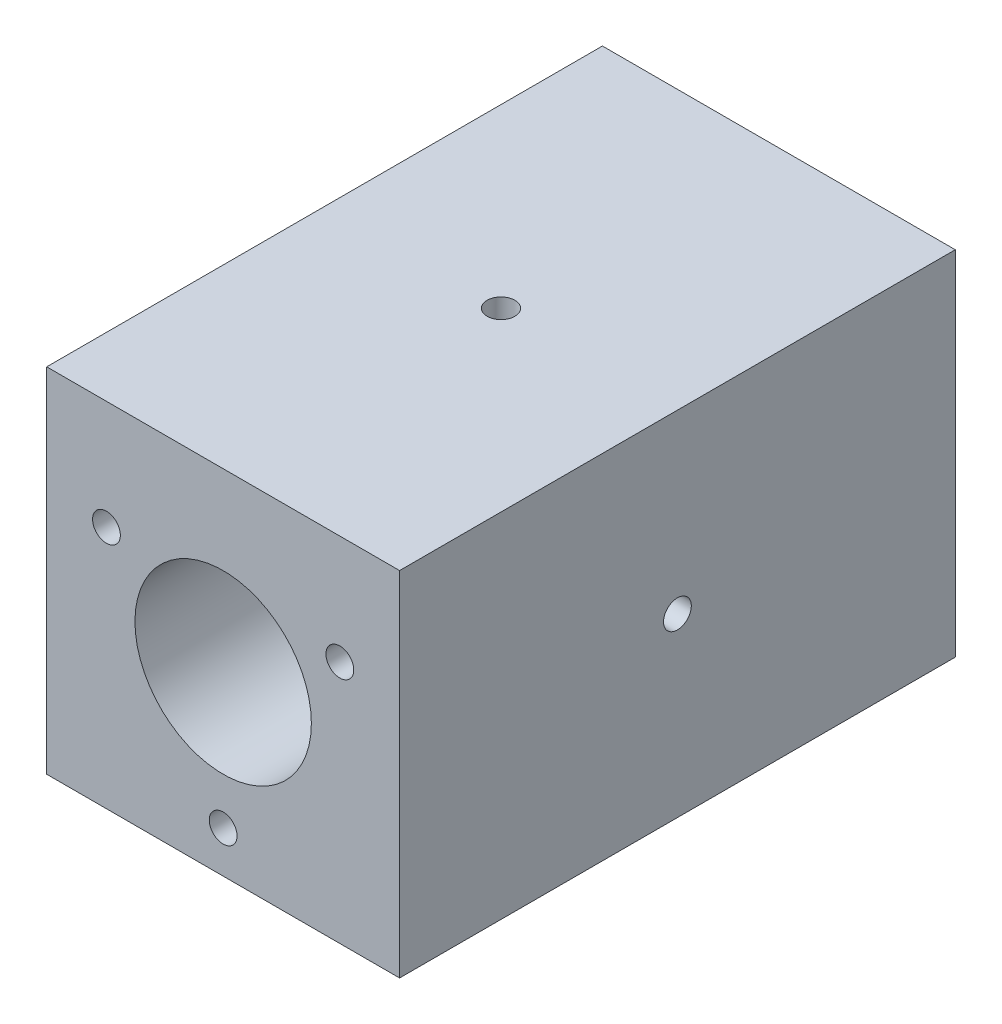
ISO-10303-21;
HEADER;
FILE_DESCRIPTION(('STEP AP214'),'2;1');
FILE_NAME('part.step','',(''),(''),'','','');
FILE_SCHEMA(('AUTOMOTIVE_DESIGN { 1 0 10303 214 1 1 1 1 }'));
ENDSEC;
DATA;
#1=APPLICATION_CONTEXT('core data for automotive mechanical design processes');
#2=APPLICATION_PROTOCOL_DEFINITION('international standard','automotive_design',2000,#1);
#3=PRODUCT_CONTEXT('',#1,'mechanical');
#4=PRODUCT('Part','Part','',(#3));
#5=PRODUCT_RELATED_PRODUCT_CATEGORY('part','',(#4));
#6=PRODUCT_DEFINITION_FORMATION('','',#4);
#7=PRODUCT_DEFINITION_CONTEXT('part definition',#1,'design');
#8=PRODUCT_DEFINITION('design','',#6,#7);
#9=PRODUCT_DEFINITION_SHAPE('','',#8);
#10=(LENGTH_UNIT() NAMED_UNIT(*) SI_UNIT(.MILLI.,.METRE.));
#11=(NAMED_UNIT(*) PLANE_ANGLE_UNIT() SI_UNIT($,.RADIAN.));
#12=(NAMED_UNIT(*) SI_UNIT($,.STERADIAN.) SOLID_ANGLE_UNIT());
#13=UNCERTAINTY_MEASURE_WITH_UNIT(LENGTH_MEASURE(1.E-05),#10,'distance_accuracy_value','');
#14=(GEOMETRIC_REPRESENTATION_CONTEXT(3) GLOBAL_UNCERTAINTY_ASSIGNED_CONTEXT((#13)) GLOBAL_UNIT_ASSIGNED_CONTEXT((#10,
#11,#12)) REPRESENTATION_CONTEXT('',''));
#15=CARTESIAN_POINT('',(0.,0.,0.));
#16=DIRECTION('',(0.,0.,1.));
#17=DIRECTION('',(1.,0.,0.));
#18=AXIS2_PLACEMENT_3D('',#15,#16,#17);
#19=CARTESIAN_POINT('',(0.,0.,25.));
#20=DIRECTION('',(0.,0.,-1.));
#21=DIRECTION('',(-1.,0.,0.));
#22=AXIS2_PLACEMENT_3D('',#19,#20,#21);
#23=PLANE('',#22);
#24=DIRECTION('',(0.,-1.,0.));
#25=VECTOR('',#24,1.);
#26=CARTESIAN_POINT('',(-15.875,15.875,25.));
#27=LINE('',#26,#25);
#28=CARTESIAN_POINT('',(-15.875,15.875,25.));
#29=VERTEX_POINT('',#28);
#30=CARTESIAN_POINT('',(-15.875,-15.875,25.));
#31=VERTEX_POINT('',#30);
#32=EDGE_CURVE('E97',#29,#31,#27,.T.);
#33=ORIENTED_EDGE('',*,*,#32,.T.);
#34=DIRECTION('',(1.,0.,0.));
#35=VECTOR('',#34,1.);
#36=CARTESIAN_POINT('',(15.875,-15.875,25.));
#37=LINE('',#36,#35);
#38=CARTESIAN_POINT('',(15.875,-15.875,25.));
#39=VERTEX_POINT('',#38);
#40=EDGE_CURVE('E92',#31,#39,#37,.T.);
#41=ORIENTED_EDGE('',*,*,#40,.T.);
#42=DIRECTION('',(0.,1.,0.));
#43=VECTOR('',#42,1.);
#44=CARTESIAN_POINT('',(15.875,15.875,25.));
#45=LINE('',#44,#43);
#46=CARTESIAN_POINT('',(15.875,15.875,25.));
#47=VERTEX_POINT('',#46);
#48=EDGE_CURVE('E95',#39,#47,#45,.T.);
#49=ORIENTED_EDGE('',*,*,#48,.T.);
#50=DIRECTION('',(-1.,0.,0.));
#51=VECTOR('',#50,1.);
#52=CARTESIAN_POINT('',(15.875,15.875,25.));
#53=LINE('',#52,#51);
#54=EDGE_CURVE('E62',#47,#29,#53,.T.);
#55=ORIENTED_EDGE('',*,*,#54,.T.);
#56=EDGE_LOOP('',(#33,#41,#49,#55));
#57=FACE_BOUND('',#56,.T.);
#58=CARTESIAN_POINT('',(0.,0.,25.));
#59=DIRECTION('',(0.,0.,1.));
#60=DIRECTION('',(1.,0.,0.));
#61=AXIS2_PLACEMENT_3D('',#58,#59,#60);
#62=CIRCLE('',#61,7.9375);
#63=CARTESIAN_POINT('',(7.93750000000001,0.,25.));
#64=VERTEX_POINT('',#63);
#65=EDGE_CURVE('E112',#64,#64,#62,.T.);
#66=ORIENTED_EDGE('',*,*,#65,.F.);
#67=EDGE_LOOP('',(#66));
#68=FACE_BOUND('',#67,.T.);
#69=CARTESIAN_POINT('',(-10.5,6.06217782649108,25.));
#70=DIRECTION('',(0.,0.,1.));
#71=DIRECTION('',(1.,0.,0.));
#72=AXIS2_PLACEMENT_3D('',#69,#70,#71);
#73=CIRCLE('',#72,1.25);
#74=CARTESIAN_POINT('',(-9.25,6.06217782649108,25.));
#75=VERTEX_POINT('',#74);
#76=EDGE_CURVE('E127',#75,#75,#73,.T.);
#77=ORIENTED_EDGE('',*,*,#76,.F.);
#78=EDGE_LOOP('',(#77));
#79=FACE_BOUND('',#78,.T.);
#80=CARTESIAN_POINT('',(10.5,6.06217782649108,25.));
#81=DIRECTION('',(0.,0.,1.));
#82=DIRECTION('',(1.,0.,0.));
#83=AXIS2_PLACEMENT_3D('',#80,#81,#82);
#84=CIRCLE('',#83,1.25);
#85=CARTESIAN_POINT('',(11.75,6.06217782649108,25.));
#86=VERTEX_POINT('',#85);
#87=EDGE_CURVE('E133',#86,#86,#84,.T.);
#88=ORIENTED_EDGE('',*,*,#87,.F.);
#89=EDGE_LOOP('',(#88));
#90=FACE_BOUND('',#89,.T.);
#91=CARTESIAN_POINT('',(0.,-12.1243556529821,25.));
#92=DIRECTION('',(0.,0.,1.));
#93=DIRECTION('',(1.,0.,0.));
#94=AXIS2_PLACEMENT_3D('',#91,#92,#93);
#95=CIRCLE('',#94,1.25);
#96=CARTESIAN_POINT('',(1.25,-12.1243556529821,25.));
#97=VERTEX_POINT('',#96);
#98=EDGE_CURVE('E139',#97,#97,#95,.T.);
#99=ORIENTED_EDGE('',*,*,#98,.F.);
#100=EDGE_LOOP('',(#99));
#101=FACE_BOUND('',#100,.T.);
#102=ADVANCED_FACE('F45',(#57,#68,#79,#90,#101),#23,.F.);
#103=CARTESIAN_POINT('',(0.,0.,-25.));
#104=DIRECTION('',(0.,0.,-1.));
#105=DIRECTION('',(-1.,0.,0.));
#106=AXIS2_PLACEMENT_3D('',#103,#104,#105);
#107=PLANE('',#106);
#108=CARTESIAN_POINT('',(10.5,6.06217782649108,-25.));
#109=DIRECTION('',(0.,0.,1.));
#110=DIRECTION('',(1.,0.,0.));
#111=AXIS2_PLACEMENT_3D('',#108,#109,#110);
#112=CIRCLE('',#111,1.25);
#113=CARTESIAN_POINT('',(11.75,6.06217782649108,-25.));
#114=VERTEX_POINT('',#113);
#115=EDGE_CURVE('E136',#114,#114,#112,.T.);
#116=ORIENTED_EDGE('',*,*,#115,.T.);
#117=EDGE_LOOP('',(#116));
#118=FACE_BOUND('',#117,.T.);
#119=CARTESIAN_POINT('',(0.,0.,-25.));
#120=DIRECTION('',(0.,0.,1.));
#121=DIRECTION('',(1.,0.,0.));
#122=AXIS2_PLACEMENT_3D('',#119,#120,#121);
#123=CIRCLE('',#122,7.9375);
#124=CARTESIAN_POINT('',(7.93750000000001,0.,-25.));
#125=VERTEX_POINT('',#124);
#126=EDGE_CURVE('E124',#125,#125,#123,.T.);
#127=ORIENTED_EDGE('',*,*,#126,.T.);
#128=EDGE_LOOP('',(#127));
#129=FACE_BOUND('',#128,.T.);
#130=DIRECTION('',(0.,-1.,0.));
#131=VECTOR('',#130,1.);
#132=CARTESIAN_POINT('',(-15.875,15.875,-25.));
#133=LINE('',#132,#131);
#134=CARTESIAN_POINT('',(-15.875,15.875,-25.));
#135=VERTEX_POINT('',#134);
#136=CARTESIAN_POINT('',(-15.875,-15.875,-25.));
#137=VERTEX_POINT('',#136);
#138=EDGE_CURVE('E109',#135,#137,#133,.T.);
#139=ORIENTED_EDGE('',*,*,#138,.F.);
#140=DIRECTION('',(-1.,0.,0.));
#141=VECTOR('',#140,1.);
#142=CARTESIAN_POINT('',(15.875,15.875,-25.));
#143=LINE('',#142,#141);
#144=CARTESIAN_POINT('',(15.875,15.875,-25.));
#145=VERTEX_POINT('',#144);
#146=EDGE_CURVE('E85',#145,#135,#143,.T.);
#147=ORIENTED_EDGE('',*,*,#146,.F.);
#148=DIRECTION('',(0.,1.,0.));
#149=VECTOR('',#148,1.);
#150=CARTESIAN_POINT('',(15.875,15.875,-25.));
#151=LINE('',#150,#149);
#152=CARTESIAN_POINT('',(15.875,-15.875,-25.));
#153=VERTEX_POINT('',#152);
#154=EDGE_CURVE('E79',#153,#145,#151,.T.);
#155=ORIENTED_EDGE('',*,*,#154,.F.);
#156=DIRECTION('',(1.,0.,0.));
#157=VECTOR('',#156,1.);
#158=CARTESIAN_POINT('',(15.875,-15.875,-25.));
#159=LINE('',#158,#157);
#160=EDGE_CURVE('E101',#137,#153,#159,.T.);
#161=ORIENTED_EDGE('',*,*,#160,.F.);
#162=EDGE_LOOP('',(#139,#147,#155,#161));
#163=FACE_BOUND('',#162,.T.);
#164=CARTESIAN_POINT('',(-10.5,6.06217782649108,-25.));
#165=DIRECTION('',(0.,0.,1.));
#166=DIRECTION('',(1.,0.,0.));
#167=AXIS2_PLACEMENT_3D('',#164,#165,#166);
#168=CIRCLE('',#167,1.25);
#169=CARTESIAN_POINT('',(-9.25,6.06217782649108,-25.));
#170=VERTEX_POINT('',#169);
#171=EDGE_CURVE('E130',#170,#170,#168,.T.);
#172=ORIENTED_EDGE('',*,*,#171,.T.);
#173=EDGE_LOOP('',(#172));
#174=FACE_BOUND('',#173,.T.);
#175=CARTESIAN_POINT('',(0.,-12.1243556529821,-25.));
#176=DIRECTION('',(0.,0.,1.));
#177=DIRECTION('',(1.,0.,0.));
#178=AXIS2_PLACEMENT_3D('',#175,#176,#177);
#179=CIRCLE('',#178,1.25);
#180=CARTESIAN_POINT('',(1.25,-12.1243556529821,-25.));
#181=VERTEX_POINT('',#180);
#182=EDGE_CURVE('E142',#181,#181,#179,.T.);
#183=ORIENTED_EDGE('',*,*,#182,.T.);
#184=EDGE_LOOP('',(#183));
#185=FACE_BOUND('',#184,.T.);
#186=ADVANCED_FACE('F120',(#118,#129,#163,#174,#185),#107,.T.);
#187=CARTESIAN_POINT('',(-15.875,15.875,25.));
#188=DIRECTION('',(1.,0.,0.));
#189=DIRECTION('',(0.,1.,0.));
#190=AXIS2_PLACEMENT_3D('',#187,#188,#189);
#191=PLANE('',#190);
#192=ORIENTED_EDGE('',*,*,#138,.T.);
#193=DIRECTION('',(0.,0.,-1.));
#194=VECTOR('',#193,1.);
#195=CARTESIAN_POINT('',(-15.875,-15.875,25.));
#196=LINE('',#195,#194);
#197=EDGE_CURVE('E11',#31,#137,#196,.T.);
#198=ORIENTED_EDGE('',*,*,#197,.F.);
#199=ORIENTED_EDGE('',*,*,#32,.F.);
#200=DIRECTION('',(0.,0.,-1.));
#201=VECTOR('',#200,1.);
#202=CARTESIAN_POINT('',(-15.875,15.875,25.));
#203=LINE('',#202,#201);
#204=EDGE_CURVE('E105',#29,#135,#203,.T.);
#205=ORIENTED_EDGE('',*,*,#204,.T.);
#206=EDGE_LOOP('',(#192,#198,#199,#205));
#207=FACE_BOUND('',#206,.T.);
#208=ADVANCED_FACE('F47',(#207),#191,.F.);
#209=CARTESIAN_POINT('',(15.875,-15.875,25.));
#210=DIRECTION('',(0.,1.,0.));
#211=DIRECTION('',(-1.,0.,0.));
#212=AXIS2_PLACEMENT_3D('',#209,#210,#211);
#213=PLANE('',#212);
#214=ORIENTED_EDGE('',*,*,#160,.T.);
#215=DIRECTION('',(0.,0.,-1.));
#216=VECTOR('',#215,1.);
#217=CARTESIAN_POINT('',(15.875,-15.875,25.));
#218=LINE('',#217,#216);
#219=EDGE_CURVE('E54',#39,#153,#218,.T.);
#220=ORIENTED_EDGE('',*,*,#219,.F.);
#221=ORIENTED_EDGE('',*,*,#40,.F.);
#222=ORIENTED_EDGE('',*,*,#197,.T.);
#223=EDGE_LOOP('',(#214,#220,#221,#222));
#224=FACE_BOUND('',#223,.T.);
#225=ADVANCED_FACE('F100',(#224),#213,.F.);
#226=CARTESIAN_POINT('',(15.875,15.875,25.));
#227=DIRECTION('',(-1.,0.,0.));
#228=DIRECTION('',(0.,-1.,0.));
#229=AXIS2_PLACEMENT_3D('',#226,#227,#228);
#230=PLANE('',#229);
#231=CARTESIAN_POINT('',(15.875,0.,0.));
#232=DIRECTION('',(1.,0.,0.));
#233=DIRECTION('',(0.,0.,-1.));
#234=AXIS2_PLACEMENT_3D('',#231,#232,#233);
#235=CIRCLE('',#234,1.24999999999999);
#236=CARTESIAN_POINT('',(15.875,0.,-1.24999999999999));
#237=VERTEX_POINT('',#236);
#238=EDGE_CURVE('E175',#237,#237,#235,.T.);
#239=ORIENTED_EDGE('',*,*,#238,.F.);
#240=EDGE_LOOP('',(#239));
#241=FACE_BOUND('',#240,.T.);
#242=ORIENTED_EDGE('',*,*,#154,.T.);
#243=DIRECTION('',(0.,0.,-1.));
#244=VECTOR('',#243,1.);
#245=CARTESIAN_POINT('',(15.875,15.875,25.));
#246=LINE('',#245,#244);
#247=EDGE_CURVE('E102',#47,#145,#246,.T.);
#248=ORIENTED_EDGE('',*,*,#247,.F.);
#249=ORIENTED_EDGE('',*,*,#48,.F.);
#250=ORIENTED_EDGE('',*,*,#219,.T.);
#251=EDGE_LOOP('',(#242,#248,#249,#250));
#252=FACE_BOUND('',#251,.T.);
#253=ADVANCED_FACE('F103',(#241,#252),#230,.F.);
#254=CARTESIAN_POINT('',(15.875,15.875,25.));
#255=DIRECTION('',(0.,-1.,0.));
#256=DIRECTION('',(1.,0.,0.));
#257=AXIS2_PLACEMENT_3D('',#254,#255,#256);
#258=PLANE('',#257);
#259=CARTESIAN_POINT('',(0.,15.875,0.));
#260=DIRECTION('',(0.,1.,0.));
#261=DIRECTION('',(0.,0.,1.));
#262=AXIS2_PLACEMENT_3D('',#259,#260,#261);
#263=CIRCLE('',#262,1.25);
#264=CARTESIAN_POINT('',(0.,15.875,1.25));
#265=VERTEX_POINT('',#264);
#266=EDGE_CURVE('E155',#265,#265,#263,.T.);
#267=ORIENTED_EDGE('',*,*,#266,.F.);
#268=EDGE_LOOP('',(#267));
#269=FACE_BOUND('',#268,.T.);
#270=ORIENTED_EDGE('',*,*,#146,.T.);
#271=ORIENTED_EDGE('',*,*,#204,.F.);
#272=ORIENTED_EDGE('',*,*,#54,.F.);
#273=ORIENTED_EDGE('',*,*,#247,.T.);
#274=EDGE_LOOP('',(#270,#271,#272,#273));
#275=FACE_BOUND('',#274,.T.);
#276=ADVANCED_FACE('F117',(#269,#275),#258,.F.);
#277=CARTESIAN_POINT('',(0.,0.,25.));
#278=DIRECTION('',(0.,0.,-1.));
#279=DIRECTION('',(-1.,0.,0.));
#280=AXIS2_PLACEMENT_3D('',#277,#278,#279);
#281=CYLINDRICAL_SURFACE('',#280,7.9375);
#282=CARTESIAN_POINT('',(7.93750000000001,0.,-1.24999999999999));
#283=CARTESIAN_POINT('',(7.93749884526427,-0.0697504150927674,-1.24999715690116));
#284=CARTESIAN_POINT('',(7.93657099739005,-0.139540255432463,-1.24414214042688));
#285=CARTESIAN_POINT('',(7.9329589474276,-0.277166301084599,-1.22088436228467));
#286=CARTESIAN_POINT('',(7.93027307667876,-0.345000586315197,-1.20347062922113));
#287=CARTESIAN_POINT('',(7.92344656155909,-0.476704125127085,-1.15763109928079));
#288=CARTESIAN_POINT('',(7.91930705658603,-0.540576438204386,-1.12921392541241));
#289=CARTESIAN_POINT('',(7.91002969799435,-0.662637137536172,-1.06219591551795));
#290=CARTESIAN_POINT('',(7.90489197232907,-0.720826250836256,-1.02359638445419));
#291=CARTESIAN_POINT('',(7.89413945906247,-0.830376856604447,-0.936956904689493));
#292=CARTESIAN_POINT('',(7.88852131381747,-0.881682542018239,-0.888846800414665));
#293=CARTESIAN_POINT('',(7.8774671865371,-0.975528165248917,-0.784702836989211));
#294=CARTESIAN_POINT('',(7.87203121543035,-1.01806757796236,-0.728668503512718));
#295=CARTESIAN_POINT('',(7.86192437477424,-1.09339319291298,-0.609888015013124));
#296=CARTESIAN_POINT('',(7.85725784468265,-1.12612487509418,-0.547106884300299));
#297=CARTESIAN_POINT('',(7.84926443015854,-1.18055738222958,-0.416852120969527));
#298=CARTESIAN_POINT('',(7.84593746514309,-1.20225887073718,-0.349378770903369));
#299=CARTESIAN_POINT('',(7.84103307296807,-1.23384053416383,-0.21224390385941));
#300=CARTESIAN_POINT('',(7.83944146000214,-1.24381661283797,-0.142604989907457));
#301=CARTESIAN_POINT('',(7.83814498405106,-1.25196148267928,-0.00262482112364988));
#302=CARTESIAN_POINT('',(7.83844000178568,-1.25013102030242,0.0677163890255272));
#303=CARTESIAN_POINT('',(7.8408704904039,-1.23479302959007,0.206423844941958));
#304=CARTESIAN_POINT('',(7.84298906258341,-1.22139271446387,0.274802285082373));
#305=CARTESIAN_POINT('',(7.84880152933236,-1.18346341997124,0.40832798997412));
#306=CARTESIAN_POINT('',(7.85249547261565,-1.15893409647064,0.473475154737981));
#307=CARTESIAN_POINT('',(7.86106095443948,-1.09933280333051,0.599012934343867));
#308=CARTESIAN_POINT('',(7.86593750418005,-1.06421581101909,0.659381817927734));
#309=CARTESIAN_POINT('',(7.87631517667283,-0.984468043254831,0.773410723001881));
#310=CARTESIAN_POINT('',(7.88181634452122,-0.939836580671971,0.82707025950237));
#311=CARTESIAN_POINT('',(7.89289789663712,-0.841740186655551,0.926778309363158));
#312=CARTESIAN_POINT('',(7.89847848488607,-0.78818315923662,0.972736240953957));
#313=CARTESIAN_POINT('',(7.90903379069807,-0.674068754426928,1.05502591003618));
#314=CARTESIAN_POINT('',(7.91400850509368,-0.613511340442199,1.09135759720391));
#315=CARTESIAN_POINT('',(7.92279753342772,-0.48703374878246,1.15336967092633));
#316=CARTESIAN_POINT('',(7.92661103736327,-0.421109868165423,1.17904262699487));
#317=CARTESIAN_POINT('',(7.9326413197818,-0.285812810610449,1.21892741584569));
#318=CARTESIAN_POINT('',(7.93485821736243,-0.216439891363735,1.23314010350756));
#319=CARTESIAN_POINT('',(7.93742962433742,-0.0769953220393042,1.24957943781758));
#320=CARTESIAN_POINT('',(7.93780347008134,-0.00693868750640217,1.25193053627866));
#321=CARTESIAN_POINT('',(7.93669942846577,0.132567999528165,1.24491092364233));
#322=CARTESIAN_POINT('',(7.93522160447956,0.202018072707433,1.2355406137093));
#323=CARTESIAN_POINT('',(7.930592235018,0.337959990056605,1.20544767489133));
#324=CARTESIAN_POINT('',(7.9274496947657,0.404465684077796,1.18478610682746));
#325=CARTESIAN_POINT('',(7.91984198415274,0.533069085734835,1.13276185501904));
#326=CARTESIAN_POINT('',(7.91537674627077,0.595166568138833,1.10139862496167));
#327=CARTESIAN_POINT('',(7.90557144085229,0.713735168663208,1.02857239567006));
#328=CARTESIAN_POINT('',(7.90022469153128,0.770157557562097,0.987030976775549));
#329=CARTESIAN_POINT('',(7.88927112786205,0.875274535241822,0.89513618584503));
#330=CARTESIAN_POINT('',(7.88366429678058,0.923968625902502,0.844782246245802));
#331=CARTESIAN_POINT('',(7.87276064936421,1.01270330904595,0.736135910684062));
#332=CARTESIAN_POINT('',(7.86746715904295,1.05266018369139,0.677774754492342));
#333=CARTESIAN_POINT('',(7.85784984125407,1.12220308672281,0.555095780085868));
#334=CARTESIAN_POINT('',(7.85352598553827,1.15178941724605,0.490778135477524));
#335=CARTESIAN_POINT('',(7.84636196860052,1.19962360576266,0.358254767835383));
#336=CARTESIAN_POINT('',(7.84351618551746,1.21791447707634,0.290064887878343));
#337=CARTESIAN_POINT('',(7.83961594231868,1.24277479070219,0.151532584450695));
#338=CARTESIAN_POINT('',(7.83856134465337,1.24934513306497,0.0811903266889055));
#339=CARTESIAN_POINT('',(7.838368363452,1.25055485297194,-0.0588148871490922));
#340=CARTESIAN_POINT('',(7.83920882920989,1.24532592110439,-0.128476711630321));
#341=CARTESIAN_POINT('',(7.8426651396402,1.22336884225765,-0.265916702805816));
#342=CARTESIAN_POINT('',(7.84528098025903,1.20664072153373,-0.333694873800527));
#343=CARTESIAN_POINT('',(7.85198562458484,1.16220839654518,-0.465400776867293));
#344=CARTESIAN_POINT('',(7.85607306729066,1.13451433170473,-0.529332003205456));
#345=CARTESIAN_POINT('',(7.86526186497778,1.06894952177457,-0.651662089270439));
#346=CARTESIAN_POINT('',(7.87036326131223,1.03107836159943,-0.710060723212201));
#347=CARTESIAN_POINT('',(7.88107276171686,0.94575959555236,-0.820335379737902));
#348=CARTESIAN_POINT('',(7.8866856639543,0.89821472887681,-0.872135695944193));
#349=CARTESIAN_POINT('',(7.89774647155334,0.79510365730607,-0.967068708971834));
#350=CARTESIAN_POINT('',(7.90319433839691,0.739535597042464,-1.01019939540202));
#351=CARTESIAN_POINT('',(7.91334950238607,0.621554416670283,-1.08680660682811));
#352=CARTESIAN_POINT('',(7.91805207548325,0.559101579903618,-1.12022258787847));
#353=CARTESIAN_POINT('',(7.92614067856452,0.429423082762671,-1.17603937605101));
#354=CARTESIAN_POINT('',(7.92952804861362,0.362202363456729,-1.19845140133676));
#355=CARTESIAN_POINT('',(7.93384613614359,0.24558107158262,-1.22663515615439));
#356=CARTESIAN_POINT('',(7.93520917367193,0.196894322586625,-1.23538330462386));
#357=CARTESIAN_POINT('',(7.93703650816938,0.0988116383781604,-1.2470666917814));
#358=CARTESIAN_POINT('',(7.93750081808962,0.0494157133956311,-1.25000201423542));
#359=CARTESIAN_POINT('',(7.93750000000001,0.,-1.24999999999999));
#360=B_SPLINE_CURVE_WITH_KNOTS('',3,(#282,#283,#284,#285,#286,#287,#288,#289,#290,#291,#292,
#293,#294,#295,#296,#297,#298,#299,#300,#301,#302,#303,#304,#305,#306,#307,#308,#309,#310,#311,
#312,#313,#314,#315,#316,#317,#318,#319,#320,#321,#322,#323,#324,#325,#326,#327,#328,#329,#330,
#331,#332,#333,#334,#335,#336,#337,#338,#339,#340,#341,#342,#343,#344,#345,#346,#347,#348,#349,
#350,#351,#352,#353,#354,#355,#356,#357,#358,#359),.UNSPECIFIED.,.T.,.F.,(4,2,2,2,2,2,2,2,2,2,2,
2,2,2,2,2,2,2,2,2,2,2,2,2,2,2,2,2,2,2,2,2,2,2,2,2,2,2,4),(0.,0.209070649752808,
0.418340031189464,0.627445746423542,0.836524675854105,1.0472076740045,1.25790328848955,
1.46974928780809,1.68158254140507,1.89167085055406,2.10174587722381,2.30989486403974,
2.51805028773291,2.72710365769201,2.93617213049288,3.14754909867532,3.35892717186415,
3.57045235592169,3.78196175978216,3.99124732286284,4.20052572335571,4.40868342979393,
4.61685176413649,4.82667739427569,5.03651654304005,5.24828586448026,5.46004901568289,
5.67100071439108,5.88193621285946,6.09052913864055,6.29912158815779,6.50752161585206,
6.71593014468972,6.92654793892305,7.13721451689053,7.34916716807057,7.56090328964163,
7.70902461878047,7.85714381339575),.UNSPECIFIED.);
#361=CARTESIAN_POINT('',(7.93750000000001,0.,-1.24999999999999));
#362=VERTEX_POINT('',#361);
#363=EDGE_CURVE('E169',#362,#362,#360,.T.);
#364=ORIENTED_EDGE('',*,*,#363,.F.);
#365=EDGE_LOOP('',(#364));
#366=FACE_BOUND('',#365,.T.);
#367=CARTESIAN_POINT('',(0.,7.9375,1.25));
#368=CARTESIAN_POINT('',(-0.0697504150927729,7.93749884526426,1.24999715690116));
#369=CARTESIAN_POINT('',(-0.139540255432468,7.93657099739004,1.24414214042688));
#370=CARTESIAN_POINT('',(-0.277166301084606,7.93295894742759,1.22088436228468));
#371=CARTESIAN_POINT('',(-0.345000586315204,7.93027307667875,1.20347062922113));
#372=CARTESIAN_POINT('',(-0.476704125127092,7.92344656155908,1.15763109928079));
#373=CARTESIAN_POINT('',(-0.540576438204393,7.91930705658602,1.12921392541241));
#374=CARTESIAN_POINT('',(-0.66263713753618,7.91002969799434,1.06219591551796));
#375=CARTESIAN_POINT('',(-0.720826250836264,7.90489197232906,1.02359638445419));
#376=CARTESIAN_POINT('',(-0.830376856604455,7.89413945906246,0.936956904689497));
#377=CARTESIAN_POINT('',(-0.881682542018248,7.88852131381746,0.888846800414669));
#378=CARTESIAN_POINT('',(-0.975528165248926,7.87746718653709,0.784702836989215));
#379=CARTESIAN_POINT('',(-1.01806757796237,7.87203121543034,0.728668503512721));
#380=CARTESIAN_POINT('',(-1.09339319291299,7.86192437477423,0.609888015013127));
#381=CARTESIAN_POINT('',(-1.12612487509419,7.85725784468263,0.547106884300301));
#382=CARTESIAN_POINT('',(-1.18055738222959,7.84926443015852,0.416852120969529));
#383=CARTESIAN_POINT('',(-1.20225887073719,7.84593746514307,0.349378770903371));
#384=CARTESIAN_POINT('',(-1.23384053416384,7.84103307296805,0.21224390385941));
#385=CARTESIAN_POINT('',(-1.24381661283798,7.83944146000212,0.142604989907458));
#386=CARTESIAN_POINT('',(-1.25196148267929,7.83814498405104,0.0026248211236497));
#387=CARTESIAN_POINT('',(-1.25013102030243,7.83844000178567,-0.0677163890255276));
#388=CARTESIAN_POINT('',(-1.23479302959008,7.84087049040389,-0.206423844941959));
#389=CARTESIAN_POINT('',(-1.22139271446388,7.84298906258339,-0.274802285082375));
#390=CARTESIAN_POINT('',(-1.18346341997125,7.84880152933235,-0.408327989974122));
#391=CARTESIAN_POINT('',(-1.15893409647065,7.85249547261564,-0.473475154737983));
#392=CARTESIAN_POINT('',(-1.09933280333052,7.86106095443947,-0.599012934343869));
#393=CARTESIAN_POINT('',(-1.0642158110191,7.86593750418003,-0.659381817927736));
#394=CARTESIAN_POINT('',(-0.98446804325484,7.87631517667281,-0.773410723001884));
#395=CARTESIAN_POINT('',(-0.93983658067198,7.8818163445212,-0.827070259502373));
#396=CARTESIAN_POINT('',(-0.84174018665556,7.89289789663711,-0.926778309363161));
#397=CARTESIAN_POINT('',(-0.788183159236628,7.89847848488606,-0.97273624095396));
#398=CARTESIAN_POINT('',(-0.674068754426936,7.90903379069806,-1.05502591003619));
#399=CARTESIAN_POINT('',(-0.613511340442207,7.91400850509367,-1.09135759720391));
#400=CARTESIAN_POINT('',(-0.487033748782468,7.92279753342771,-1.15336967092634));
#401=CARTESIAN_POINT('',(-0.42110986816543,7.92661103736326,-1.17904262699488));
#402=CARTESIAN_POINT('',(-0.285812810610455,7.93264131978179,-1.2189274158457));
#403=CARTESIAN_POINT('',(-0.216439891363741,7.93485821736242,-1.23314010350756));
#404=CARTESIAN_POINT('',(-0.07699532203931,7.93742962433741,-1.24957943781759));
#405=CARTESIAN_POINT('',(-0.00693868750640761,7.93780347008132,-1.25193053627867));
#406=CARTESIAN_POINT('',(0.13256799952816,7.93669942846577,-1.24491092364233));
#407=CARTESIAN_POINT('',(0.202018072707429,7.93522160447955,-1.2355406137093));
#408=CARTESIAN_POINT('',(0.337959990056601,7.93059223501799,-1.20544767489133));
#409=CARTESIAN_POINT('',(0.404465684077792,7.92744969476569,-1.18478610682746));
#410=CARTESIAN_POINT('',(0.533069085734832,7.91984198415273,-1.13276185501904));
#411=CARTESIAN_POINT('',(0.59516656813883,7.91537674627076,-1.10139862496168));
#412=CARTESIAN_POINT('',(0.713735168663206,7.90557144085228,-1.02857239567006));
#413=CARTESIAN_POINT('',(0.770157557562095,7.90022469153127,-0.987030976775553));
#414=CARTESIAN_POINT('',(0.87527453524182,7.88927112786204,-0.895136185845034));
#415=CARTESIAN_POINT('',(0.923968625902501,7.88366429678057,-0.844782246245806));
#416=CARTESIAN_POINT('',(1.01270330904595,7.8727606493642,-0.736135910684065));
#417=CARTESIAN_POINT('',(1.05266018369139,7.86746715904294,-0.677774754492345));
#418=CARTESIAN_POINT('',(1.12220308672281,7.85784984125406,-0.555095780085871));
#419=CARTESIAN_POINT('',(1.15178941724604,7.85352598553826,-0.490778135477527));
#420=CARTESIAN_POINT('',(1.19962360576266,7.84636196860052,-0.358254767835385));
#421=CARTESIAN_POINT('',(1.21791447707634,7.84351618551746,-0.290064887878345));
#422=CARTESIAN_POINT('',(1.24277479070219,7.83961594231868,-0.151532584450696));
#423=CARTESIAN_POINT('',(1.24934513306497,7.83856134465336,-0.081190326688906));
#424=CARTESIAN_POINT('',(1.25055485297194,7.83836836345199,0.0588148871490924));
#425=CARTESIAN_POINT('',(1.24532592110439,7.83920882920988,0.128476711630321));
#426=CARTESIAN_POINT('',(1.22336884225765,7.84266513964019,0.265916702805817));
#427=CARTESIAN_POINT('',(1.20664072153373,7.84528098025902,0.333694873800528));
#428=CARTESIAN_POINT('',(1.16220839654518,7.85198562458483,0.465400776867295));
#429=CARTESIAN_POINT('',(1.13451433170473,7.85607306729065,0.529332003205459));
#430=CARTESIAN_POINT('',(1.06894952177457,7.86526186497777,0.651662089270441));
#431=CARTESIAN_POINT('',(1.03107836159943,7.87036326131223,0.710060723212204));
#432=CARTESIAN_POINT('',(0.945759595552359,7.88107276171685,0.820335379737906));
#433=CARTESIAN_POINT('',(0.898214728876809,7.88668566395429,0.872135695944197));
#434=CARTESIAN_POINT('',(0.795103657306068,7.89774647155333,0.967068708971838));
#435=CARTESIAN_POINT('',(0.739535597042462,7.90319433839689,1.01019939540203));
#436=CARTESIAN_POINT('',(0.62155441667028,7.91334950238606,1.08680660682812));
#437=CARTESIAN_POINT('',(0.559101579903616,7.91805207548324,1.12022258787847));
#438=CARTESIAN_POINT('',(0.429423082762668,7.92614067856451,1.17603937605102));
#439=CARTESIAN_POINT('',(0.362202363456725,7.92952804861361,1.19845140133677));
#440=CARTESIAN_POINT('',(0.245581071582616,7.93384613614358,1.22663515615439));
#441=CARTESIAN_POINT('',(0.196894322586621,7.93520917367192,1.23538330462386));
#442=CARTESIAN_POINT('',(0.0988116383781559,7.93703650816937,1.2470666917814));
#443=CARTESIAN_POINT('',(0.0494157133956262,7.93750081808961,1.25000201423542));
#444=CARTESIAN_POINT('',(0.,7.9375,1.25));
#445=B_SPLINE_CURVE_WITH_KNOTS('',3,(#367,#368,#369,#370,#371,#372,#373,#374,#375,#376,#377,
#378,#379,#380,#381,#382,#383,#384,#385,#386,#387,#388,#389,#390,#391,#392,#393,#394,#395,#396,
#397,#398,#399,#400,#401,#402,#403,#404,#405,#406,#407,#408,#409,#410,#411,#412,#413,#414,#415,
#416,#417,#418,#419,#420,#421,#422,#423,#424,#425,#426,#427,#428,#429,#430,#431,#432,#433,#434,
#435,#436,#437,#438,#439,#440,#441,#442,#443,#444),.UNSPECIFIED.,.T.,.F.,(4,2,2,2,2,2,2,2,2,2,2,
2,2,2,2,2,2,2,2,2,2,2,2,2,2,2,2,2,2,2,2,2,2,2,2,2,2,2,4),(0.,0.209070649752809,
0.418340031189465,0.627445746423545,0.836524675854109,1.04720767400451,1.25790328848956,
1.4697492878081,1.68158254140508,1.89167085055407,2.10174587722382,2.30989486403976,
2.51805028773292,2.72710365769202,2.93617213049289,3.14754909867534,3.35892717186417,
3.57045235592171,3.78196175978217,3.99124732286286,4.20052572335573,4.40868342979395,
4.61685176413651,4.82667739427572,5.03651654304007,5.24828586448028,5.46004901568291,
5.6710007143911,5.88193621285949,6.09052913864058,6.29912158815782,6.50752161585209,
6.71593014468975,6.92654793892308,7.13721451689057,7.34916716807061,7.56090328964167,
7.7090246187805,7.85714381339579),.UNSPECIFIED.);
#446=CARTESIAN_POINT('',(0.,7.9375,1.25));
#447=VERTEX_POINT('',#446);
#448=EDGE_CURVE('E145',#447,#447,#445,.T.);
#449=ORIENTED_EDGE('',*,*,#448,.F.);
#450=EDGE_LOOP('',(#449));
#451=FACE_BOUND('',#450,.T.);
#452=ORIENTED_EDGE('',*,*,#65,.T.);
#453=EDGE_LOOP('',(#452));
#454=FACE_BOUND('',#453,.T.);
#455=ORIENTED_EDGE('',*,*,#126,.F.);
#456=EDGE_LOOP('',(#455));
#457=FACE_BOUND('',#456,.T.);
#458=ADVANCED_FACE('F187',(#366,#451,#454,#457),#281,.F.);
#459=CARTESIAN_POINT('',(-10.5,6.06217782649108,25.));
#460=DIRECTION('',(0.,0.,-1.));
#461=DIRECTION('',(-1.,0.,0.));
#462=AXIS2_PLACEMENT_3D('',#459,#460,#461);
#463=CYLINDRICAL_SURFACE('',#462,1.25);
#464=ORIENTED_EDGE('',*,*,#76,.T.);
#465=EDGE_LOOP('',(#464));
#466=FACE_BOUND('',#465,.T.);
#467=ORIENTED_EDGE('',*,*,#171,.F.);
#468=EDGE_LOOP('',(#467));
#469=FACE_BOUND('',#468,.T.);
#470=ADVANCED_FACE('F201',(#466,#469),#463,.F.);
#471=CARTESIAN_POINT('',(10.5,6.06217782649108,25.));
#472=DIRECTION('',(0.,0.,-1.));
#473=DIRECTION('',(-1.,0.,0.));
#474=AXIS2_PLACEMENT_3D('',#471,#472,#473);
#475=CYLINDRICAL_SURFACE('',#474,1.25);
#476=ORIENTED_EDGE('',*,*,#87,.T.);
#477=EDGE_LOOP('',(#476));
#478=FACE_BOUND('',#477,.T.);
#479=ORIENTED_EDGE('',*,*,#115,.F.);
#480=EDGE_LOOP('',(#479));
#481=FACE_BOUND('',#480,.T.);
#482=ADVANCED_FACE('F205',(#478,#481),#475,.F.);
#483=CARTESIAN_POINT('',(0.,-12.1243556529821,25.));
#484=DIRECTION('',(0.,0.,-1.));
#485=DIRECTION('',(-1.,0.,0.));
#486=AXIS2_PLACEMENT_3D('',#483,#484,#485);
#487=CYLINDRICAL_SURFACE('',#486,1.25);
#488=ORIENTED_EDGE('',*,*,#98,.T.);
#489=EDGE_LOOP('',(#488));
#490=FACE_BOUND('',#489,.T.);
#491=ORIENTED_EDGE('',*,*,#182,.F.);
#492=EDGE_LOOP('',(#491));
#493=FACE_BOUND('',#492,.T.);
#494=ADVANCED_FACE('F164',(#490,#493),#487,.F.);
#495=CARTESIAN_POINT('',(0.,15.875,0.));
#496=DIRECTION('',(0.,1.,0.));
#497=DIRECTION('',(0.,0.,1.));
#498=AXIS2_PLACEMENT_3D('',#495,#496,#497);
#499=CYLINDRICAL_SURFACE('',#498,1.25);
#500=ORIENTED_EDGE('',*,*,#266,.T.);
#501=EDGE_LOOP('',(#500));
#502=FACE_BOUND('',#501,.T.);
#503=ORIENTED_EDGE('',*,*,#448,.T.);
#504=EDGE_LOOP('',(#503));
#505=FACE_BOUND('',#504,.T.);
#506=ADVANCED_FACE('F159',(#502,#505),#499,.F.);
#507=CARTESIAN_POINT('',(15.875,0.,0.));
#508=DIRECTION('',(1.,0.,0.));
#509=DIRECTION('',(0.,0.,-1.));
#510=AXIS2_PLACEMENT_3D('',#507,#508,#509);
#511=CYLINDRICAL_SURFACE('',#510,1.24999999999999);
#512=ORIENTED_EDGE('',*,*,#238,.T.);
#513=EDGE_LOOP('',(#512));
#514=FACE_BOUND('',#513,.T.);
#515=ORIENTED_EDGE('',*,*,#363,.T.);
#516=EDGE_LOOP('',(#515));
#517=FACE_BOUND('',#516,.T.);
#518=ADVANCED_FACE('F163',(#514,#517),#511,.F.);
#519=CLOSED_SHELL('',(#102,#186,#208,#225,#253,#276,#458,#470,#482,#494,#506,#518));
#520=MANIFOLD_SOLID_BREP('B2',#519);
#521=ADVANCED_BREP_SHAPE_REPRESENTATION('',(#18,#520),#14);
#522=SHAPE_DEFINITION_REPRESENTATION(#9,#521);
ENDSEC;
END-ISO-10303-21;
